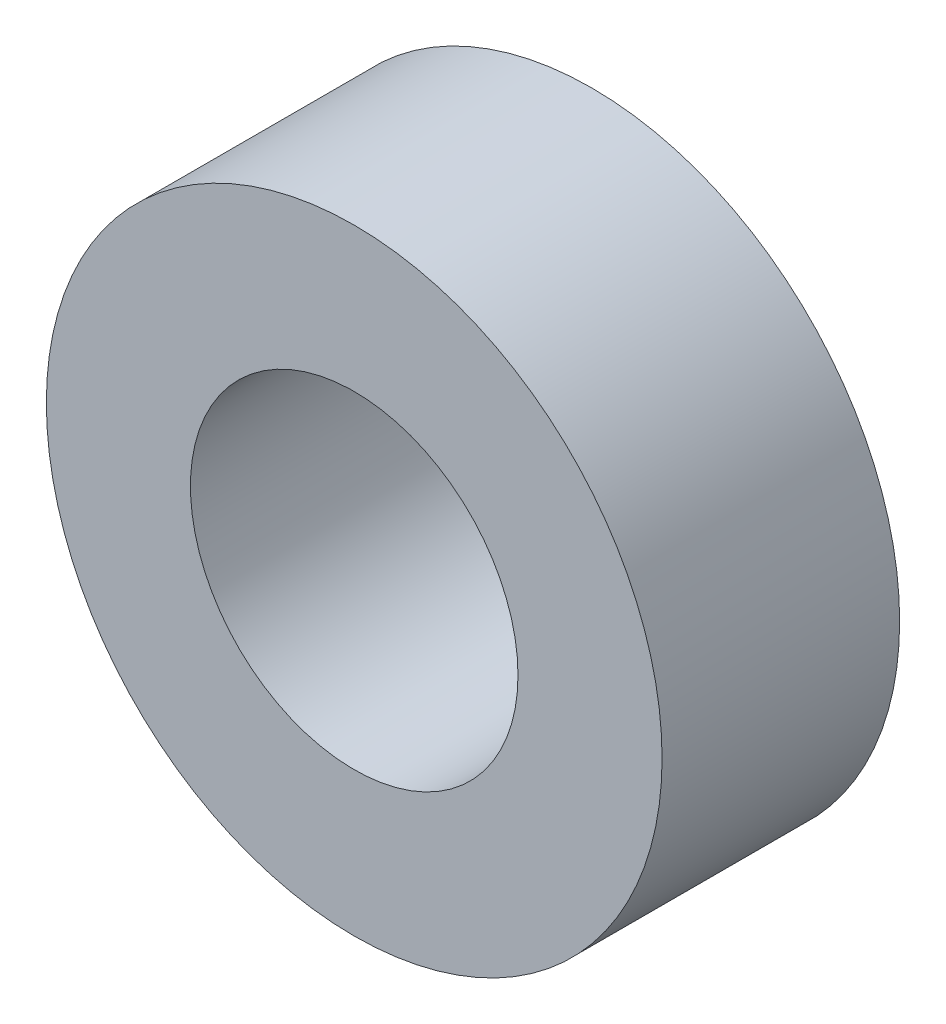
ISO-10303-21;
HEADER;
FILE_DESCRIPTION(('STEP AP214'),'2;1');
FILE_NAME('part.step','',(''),(''),'','','');
FILE_SCHEMA(('AUTOMOTIVE_DESIGN { 1 0 10303 214 1 1 1 1 }'));
ENDSEC;
DATA;
#1=APPLICATION_CONTEXT('core data for automotive mechanical design processes');
#2=APPLICATION_PROTOCOL_DEFINITION('international standard','automotive_design',2000,#1);
#3=PRODUCT_CONTEXT('',#1,'mechanical');
#4=PRODUCT('Part','Part','',(#3));
#5=PRODUCT_RELATED_PRODUCT_CATEGORY('part','',(#4));
#6=PRODUCT_DEFINITION_FORMATION('','',#4);
#7=PRODUCT_DEFINITION_CONTEXT('part definition',#1,'design');
#8=PRODUCT_DEFINITION('design','',#6,#7);
#9=PRODUCT_DEFINITION_SHAPE('','',#8);
#10=(LENGTH_UNIT() NAMED_UNIT(*) SI_UNIT(.MILLI.,.METRE.));
#11=(NAMED_UNIT(*) PLANE_ANGLE_UNIT() SI_UNIT($,.RADIAN.));
#12=(NAMED_UNIT(*) SI_UNIT($,.STERADIAN.) SOLID_ANGLE_UNIT());
#13=UNCERTAINTY_MEASURE_WITH_UNIT(LENGTH_MEASURE(1.E-05),#10,'distance_accuracy_value','');
#14=(GEOMETRIC_REPRESENTATION_CONTEXT(3) GLOBAL_UNCERTAINTY_ASSIGNED_CONTEXT((#13)) GLOBAL_UNIT_ASSIGNED_CONTEXT((#10,
#11,#12)) REPRESENTATION_CONTEXT('',''));
#15=CARTESIAN_POINT('',(0.,0.,0.));
#16=DIRECTION('',(0.,0.,1.));
#17=DIRECTION('',(1.,0.,0.));
#18=AXIS2_PLACEMENT_3D('',#15,#16,#17);
#19=CARTESIAN_POINT('',(0.,0.,4.9));
#20=DIRECTION('',(0.,0.,1.));
#21=DIRECTION('',(1.,0.,0.));
#22=AXIS2_PLACEMENT_3D('',#19,#20,#21);
#23=PLANE('',#22);
#24=CARTESIAN_POINT('',(0.,0.,4.9));
#25=DIRECTION('',(0.,0.,1.));
#26=DIRECTION('',(1.,0.,0.));
#27=AXIS2_PLACEMENT_3D('',#24,#25,#26);
#28=CIRCLE('',#27,6.35);
#29=CARTESIAN_POINT('',(6.35,0.,4.9));
#30=VERTEX_POINT('',#29);
#31=EDGE_CURVE('E10',#30,#30,#28,.T.);
#32=ORIENTED_EDGE('',*,*,#31,.T.);
#33=EDGE_LOOP('',(#32));
#34=FACE_BOUND('',#33,.T.);
#35=CARTESIAN_POINT('',(0.,0.,4.9));
#36=DIRECTION('',(0.,0.,1.));
#37=DIRECTION('',(1.,0.,0.));
#38=AXIS2_PLACEMENT_3D('',#35,#36,#37);
#39=CIRCLE('',#38,3.3782);
#40=CARTESIAN_POINT('',(3.3782,0.,4.9));
#41=VERTEX_POINT('',#40);
#42=EDGE_CURVE('E42',#41,#41,#39,.T.);
#43=ORIENTED_EDGE('',*,*,#42,.F.);
#44=EDGE_LOOP('',(#43));
#45=FACE_BOUND('',#44,.T.);
#46=ADVANCED_FACE('F31',(#34,#45),#23,.T.);
#47=CARTESIAN_POINT('',(0.,0.,0.));
#48=DIRECTION('',(0.,0.,1.));
#49=DIRECTION('',(1.,0.,0.));
#50=AXIS2_PLACEMENT_3D('',#47,#48,#49);
#51=PLANE('',#50);
#52=CARTESIAN_POINT('',(0.,0.,0.));
#53=DIRECTION('',(0.,0.,1.));
#54=DIRECTION('',(1.,0.,0.));
#55=AXIS2_PLACEMENT_3D('',#52,#53,#54);
#56=CIRCLE('',#55,6.35);
#57=CARTESIAN_POINT('',(6.35,0.,0.));
#58=VERTEX_POINT('',#57);
#59=EDGE_CURVE('E35',#58,#58,#56,.T.);
#60=ORIENTED_EDGE('',*,*,#59,.F.);
#61=EDGE_LOOP('',(#60));
#62=FACE_BOUND('',#61,.T.);
#63=CARTESIAN_POINT('',(0.,0.,0.));
#64=DIRECTION('',(0.,0.,1.));
#65=DIRECTION('',(1.,0.,0.));
#66=AXIS2_PLACEMENT_3D('',#63,#64,#65);
#67=CIRCLE('',#66,3.3782);
#68=CARTESIAN_POINT('',(3.3782,0.,0.));
#69=VERTEX_POINT('',#68);
#70=EDGE_CURVE('E44',#69,#69,#67,.T.);
#71=ORIENTED_EDGE('',*,*,#70,.T.);
#72=EDGE_LOOP('',(#71));
#73=FACE_BOUND('',#72,.T.);
#74=ADVANCED_FACE('F54',(#62,#73),#51,.F.);
#75=CARTESIAN_POINT('',(0.,0.,4.9));
#76=DIRECTION('',(0.,0.,-1.));
#77=DIRECTION('',(-1.,0.,0.));
#78=AXIS2_PLACEMENT_3D('',#75,#76,#77);
#79=CYLINDRICAL_SURFACE('',#78,6.35);
#80=ORIENTED_EDGE('',*,*,#31,.F.);
#81=EDGE_LOOP('',(#80));
#82=FACE_BOUND('',#81,.T.);
#83=ORIENTED_EDGE('',*,*,#59,.T.);
#84=EDGE_LOOP('',(#83));
#85=FACE_BOUND('',#84,.T.);
#86=ADVANCED_FACE('F33',(#82,#85),#79,.T.);
#87=CARTESIAN_POINT('',(0.,0.,4.9));
#88=DIRECTION('',(0.,0.,-1.));
#89=DIRECTION('',(-1.,0.,0.));
#90=AXIS2_PLACEMENT_3D('',#87,#88,#89);
#91=CYLINDRICAL_SURFACE('',#90,3.3782);
#92=ORIENTED_EDGE('',*,*,#42,.T.);
#93=EDGE_LOOP('',(#92));
#94=FACE_BOUND('',#93,.T.);
#95=ORIENTED_EDGE('',*,*,#70,.F.);
#96=EDGE_LOOP('',(#95));
#97=FACE_BOUND('',#96,.T.);
#98=ADVANCED_FACE('F50',(#94,#97),#91,.F.);
#99=CLOSED_SHELL('',(#46,#74,#86,#98));
#100=MANIFOLD_SOLID_BREP('B2',#99);
#101=ADVANCED_BREP_SHAPE_REPRESENTATION('',(#18,#100),#14);
#102=SHAPE_DEFINITION_REPRESENTATION(#9,#101);
ENDSEC;
END-ISO-10303-21;
